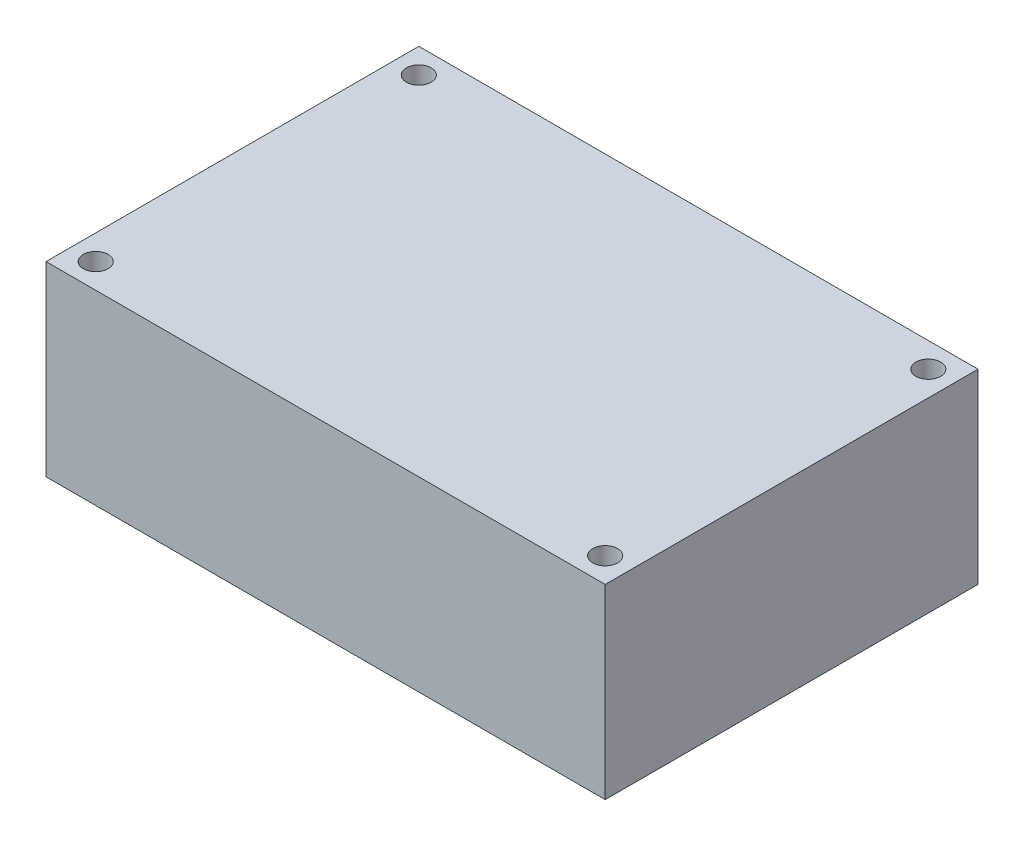
ISO-10303-21;
HEADER;
FILE_DESCRIPTION(('STEP AP214'),'2;1');
FILE_NAME('part.step','',(''),(''),'','','');
FILE_SCHEMA(('AUTOMOTIVE_DESIGN { 1 0 10303 214 1 1 1 1 }'));
ENDSEC;
DATA;
#1=APPLICATION_CONTEXT('core data for automotive mechanical design processes');
#2=APPLICATION_PROTOCOL_DEFINITION('international standard','automotive_design',2000,#1);
#3=PRODUCT_CONTEXT('',#1,'mechanical');
#4=PRODUCT('Part','Part','',(#3));
#5=PRODUCT_RELATED_PRODUCT_CATEGORY('part','',(#4));
#6=PRODUCT_DEFINITION_FORMATION('','',#4);
#7=PRODUCT_DEFINITION_CONTEXT('part definition',#1,'design');
#8=PRODUCT_DEFINITION('design','',#6,#7);
#9=PRODUCT_DEFINITION_SHAPE('','',#8);
#10=(LENGTH_UNIT() NAMED_UNIT(*) SI_UNIT(.MILLI.,.METRE.));
#11=(NAMED_UNIT(*) PLANE_ANGLE_UNIT() SI_UNIT($,.RADIAN.));
#12=(NAMED_UNIT(*) SI_UNIT($,.STERADIAN.) SOLID_ANGLE_UNIT());
#13=UNCERTAINTY_MEASURE_WITH_UNIT(LENGTH_MEASURE(1.E-05),#10,'distance_accuracy_value','');
#14=(GEOMETRIC_REPRESENTATION_CONTEXT(3) GLOBAL_UNCERTAINTY_ASSIGNED_CONTEXT((#13)) GLOBAL_UNIT_ASSIGNED_CONTEXT((#10,
#11,#12)) REPRESENTATION_CONTEXT('',''));
#15=CARTESIAN_POINT('',(0.,0.,0.));
#16=DIRECTION('',(0.,0.,1.));
#17=DIRECTION('',(1.,0.,0.));
#18=AXIS2_PLACEMENT_3D('',#15,#16,#17);
#19=CARTESIAN_POINT('',(0.,15.,0.));
#20=DIRECTION('',(0.,-1.,0.));
#21=DIRECTION('',(0.,0.,-1.));
#22=AXIS2_PLACEMENT_3D('',#19,#20,#21);
#23=PLANE('',#22);
#24=DIRECTION('',(0.,0.,-1.));
#25=VECTOR('',#24,1.);
#26=CARTESIAN_POINT('',(0.,15.,0.));
#27=LINE('',#26,#25);
#28=CARTESIAN_POINT('',(0.,15.,30.));
#29=VERTEX_POINT('',#28);
#30=CARTESIAN_POINT('',(0.,15.,0.));
#31=VERTEX_POINT('',#30);
#32=EDGE_CURVE('E85',#29,#31,#27,.T.);
#33=ORIENTED_EDGE('',*,*,#32,.T.);
#34=DIRECTION('',(-1.,0.,0.));
#35=VECTOR('',#34,1.);
#36=CARTESIAN_POINT('',(0.,15.,0.));
#37=LINE('',#36,#35);
#38=CARTESIAN_POINT('',(-45.,15.,0.));
#39=VERTEX_POINT('',#38);
#40=EDGE_CURVE('E80',#31,#39,#37,.T.);
#41=ORIENTED_EDGE('',*,*,#40,.T.);
#42=DIRECTION('',(0.,0.,1.));
#43=VECTOR('',#42,1.);
#44=CARTESIAN_POINT('',(-45.,15.,0.));
#45=LINE('',#44,#43);
#46=CARTESIAN_POINT('',(-45.,15.,30.));
#47=VERTEX_POINT('',#46);
#48=EDGE_CURVE('E83',#39,#47,#45,.T.);
#49=ORIENTED_EDGE('',*,*,#48,.T.);
#50=DIRECTION('',(1.,0.,0.));
#51=VECTOR('',#50,1.);
#52=CARTESIAN_POINT('',(0.,15.,30.));
#53=LINE('',#52,#51);
#54=EDGE_CURVE('E50',#47,#29,#53,.T.);
#55=ORIENTED_EDGE('',*,*,#54,.T.);
#56=EDGE_LOOP('',(#33,#41,#49,#55));
#57=FACE_BOUND('',#56,.T.);
#58=CARTESIAN_POINT('',(-43.,15.,28.));
#59=DIRECTION('',(0.,1.,0.));
#60=DIRECTION('',(0.,0.,1.));
#61=AXIS2_PLACEMENT_3D('',#58,#59,#60);
#62=CIRCLE('',#61,0.999999999999998);
#63=CARTESIAN_POINT('',(-43.,15.,29.));
#64=VERTEX_POINT('',#63);
#65=EDGE_CURVE('E100',#64,#64,#62,.T.);
#66=ORIENTED_EDGE('',*,*,#65,.F.);
#67=EDGE_LOOP('',(#66));
#68=FACE_BOUND('',#67,.T.);
#69=CARTESIAN_POINT('',(-43.,15.,2.00000000000001));
#70=DIRECTION('',(0.,1.,0.));
#71=DIRECTION('',(0.,0.,1.));
#72=AXIS2_PLACEMENT_3D('',#69,#70,#71);
#73=CIRCLE('',#72,0.999999999999998);
#74=CARTESIAN_POINT('',(-43.,15.,3.));
#75=VERTEX_POINT('',#74);
#76=EDGE_CURVE('E115',#75,#75,#73,.T.);
#77=ORIENTED_EDGE('',*,*,#76,.F.);
#78=EDGE_LOOP('',(#77));
#79=FACE_BOUND('',#78,.T.);
#80=CARTESIAN_POINT('',(-2.,15.,2.00000000000001));
#81=DIRECTION('',(0.,1.,0.));
#82=DIRECTION('',(0.,0.,1.));
#83=AXIS2_PLACEMENT_3D('',#80,#81,#82);
#84=CIRCLE('',#83,1.);
#85=CARTESIAN_POINT('',(-2.,15.,3.00000000000001));
#86=VERTEX_POINT('',#85);
#87=EDGE_CURVE('E121',#86,#86,#84,.T.);
#88=ORIENTED_EDGE('',*,*,#87,.F.);
#89=EDGE_LOOP('',(#88));
#90=FACE_BOUND('',#89,.T.);
#91=CARTESIAN_POINT('',(-2.,15.,28.));
#92=DIRECTION('',(0.,1.,0.));
#93=DIRECTION('',(0.,0.,1.));
#94=AXIS2_PLACEMENT_3D('',#91,#92,#93);
#95=CIRCLE('',#94,1.);
#96=CARTESIAN_POINT('',(-2.,15.,29.));
#97=VERTEX_POINT('',#96);
#98=EDGE_CURVE('E127',#97,#97,#95,.T.);
#99=ORIENTED_EDGE('',*,*,#98,.F.);
#100=EDGE_LOOP('',(#99));
#101=FACE_BOUND('',#100,.T.);
#102=ADVANCED_FACE('F33',(#57,#68,#79,#90,#101),#23,.F.);
#103=CARTESIAN_POINT('',(0.,0.,0.));
#104=DIRECTION('',(0.,-1.,0.));
#105=DIRECTION('',(0.,0.,-1.));
#106=AXIS2_PLACEMENT_3D('',#103,#104,#105);
#107=PLANE('',#106);
#108=CARTESIAN_POINT('',(-2.,0.,2.00000000000001));
#109=DIRECTION('',(0.,1.,0.));
#110=DIRECTION('',(0.,0.,1.));
#111=AXIS2_PLACEMENT_3D('',#108,#109,#110);
#112=CIRCLE('',#111,1.);
#113=CARTESIAN_POINT('',(-2.,0.,3.00000000000001));
#114=VERTEX_POINT('',#113);
#115=EDGE_CURVE('E124',#114,#114,#112,.T.);
#116=ORIENTED_EDGE('',*,*,#115,.T.);
#117=EDGE_LOOP('',(#116));
#118=FACE_BOUND('',#117,.T.);
#119=CARTESIAN_POINT('',(-43.,0.,28.));
#120=DIRECTION('',(0.,1.,0.));
#121=DIRECTION('',(0.,0.,1.));
#122=AXIS2_PLACEMENT_3D('',#119,#120,#121);
#123=CIRCLE('',#122,0.999999999999998);
#124=CARTESIAN_POINT('',(-43.,0.,29.));
#125=VERTEX_POINT('',#124);
#126=EDGE_CURVE('E112',#125,#125,#123,.T.);
#127=ORIENTED_EDGE('',*,*,#126,.T.);
#128=EDGE_LOOP('',(#127));
#129=FACE_BOUND('',#128,.T.);
#130=DIRECTION('',(0.,0.,-1.));
#131=VECTOR('',#130,1.);
#132=CARTESIAN_POINT('',(0.,0.,0.));
#133=LINE('',#132,#131);
#134=CARTESIAN_POINT('',(0.,0.,30.));
#135=VERTEX_POINT('',#134);
#136=CARTESIAN_POINT('',(0.,0.,0.));
#137=VERTEX_POINT('',#136);
#138=EDGE_CURVE('E97',#135,#137,#133,.T.);
#139=ORIENTED_EDGE('',*,*,#138,.F.);
#140=DIRECTION('',(1.,0.,0.));
#141=VECTOR('',#140,1.);
#142=CARTESIAN_POINT('',(0.,0.,30.));
#143=LINE('',#142,#141);
#144=CARTESIAN_POINT('',(-45.,0.,30.));
#145=VERTEX_POINT('',#144);
#146=EDGE_CURVE('E73',#145,#135,#143,.T.);
#147=ORIENTED_EDGE('',*,*,#146,.F.);
#148=DIRECTION('',(0.,0.,1.));
#149=VECTOR('',#148,1.);
#150=CARTESIAN_POINT('',(-45.,0.,0.));
#151=LINE('',#150,#149);
#152=CARTESIAN_POINT('',(-45.,0.,0.));
#153=VERTEX_POINT('',#152);
#154=EDGE_CURVE('E67',#153,#145,#151,.T.);
#155=ORIENTED_EDGE('',*,*,#154,.F.);
#156=DIRECTION('',(-1.,0.,0.));
#157=VECTOR('',#156,1.);
#158=CARTESIAN_POINT('',(0.,0.,0.));
#159=LINE('',#158,#157);
#160=EDGE_CURVE('E89',#137,#153,#159,.T.);
#161=ORIENTED_EDGE('',*,*,#160,.F.);
#162=EDGE_LOOP('',(#139,#147,#155,#161));
#163=FACE_BOUND('',#162,.T.);
#164=CARTESIAN_POINT('',(-43.,0.,2.00000000000001));
#165=DIRECTION('',(0.,1.,0.));
#166=DIRECTION('',(0.,0.,1.));
#167=AXIS2_PLACEMENT_3D('',#164,#165,#166);
#168=CIRCLE('',#167,0.999999999999998);
#169=CARTESIAN_POINT('',(-43.,0.,3.));
#170=VERTEX_POINT('',#169);
#171=EDGE_CURVE('E118',#170,#170,#168,.T.);
#172=ORIENTED_EDGE('',*,*,#171,.T.);
#173=EDGE_LOOP('',(#172));
#174=FACE_BOUND('',#173,.T.);
#175=CARTESIAN_POINT('',(-2.,0.,28.));
#176=DIRECTION('',(0.,1.,0.));
#177=DIRECTION('',(0.,0.,1.));
#178=AXIS2_PLACEMENT_3D('',#175,#176,#177);
#179=CIRCLE('',#178,1.);
#180=CARTESIAN_POINT('',(-2.,0.,29.));
#181=VERTEX_POINT('',#180);
#182=EDGE_CURVE('E130',#181,#181,#179,.T.);
#183=ORIENTED_EDGE('',*,*,#182,.T.);
#184=EDGE_LOOP('',(#183));
#185=FACE_BOUND('',#184,.T.);
#186=ADVANCED_FACE('F108',(#118,#129,#163,#174,#185),#107,.T.);
#187=CARTESIAN_POINT('',(0.,15.,0.));
#188=DIRECTION('',(-1.,0.,0.));
#189=DIRECTION('',(0.,0.,1.));
#190=AXIS2_PLACEMENT_3D('',#187,#188,#189);
#191=PLANE('',#190);
#192=ORIENTED_EDGE('',*,*,#138,.T.);
#193=DIRECTION('',(0.,-1.,0.));
#194=VECTOR('',#193,1.);
#195=CARTESIAN_POINT('',(0.,15.,0.));
#196=LINE('',#195,#194);
#197=EDGE_CURVE('E11',#31,#137,#196,.T.);
#198=ORIENTED_EDGE('',*,*,#197,.F.);
#199=ORIENTED_EDGE('',*,*,#32,.F.);
#200=DIRECTION('',(0.,-1.,0.));
#201=VECTOR('',#200,1.);
#202=CARTESIAN_POINT('',(0.,15.,30.));
#203=LINE('',#202,#201);
#204=EDGE_CURVE('E93',#29,#135,#203,.T.);
#205=ORIENTED_EDGE('',*,*,#204,.T.);
#206=EDGE_LOOP('',(#192,#198,#199,#205));
#207=FACE_BOUND('',#206,.T.);
#208=ADVANCED_FACE('F35',(#207),#191,.F.);
#209=CARTESIAN_POINT('',(0.,15.,0.));
#210=DIRECTION('',(0.,0.,1.));
#211=DIRECTION('',(1.,0.,0.));
#212=AXIS2_PLACEMENT_3D('',#209,#210,#211);
#213=PLANE('',#212);
#214=ORIENTED_EDGE('',*,*,#160,.T.);
#215=DIRECTION('',(0.,-1.,0.));
#216=VECTOR('',#215,1.);
#217=CARTESIAN_POINT('',(-45.,15.,0.));
#218=LINE('',#217,#216);
#219=EDGE_CURVE('E42',#39,#153,#218,.T.);
#220=ORIENTED_EDGE('',*,*,#219,.F.);
#221=ORIENTED_EDGE('',*,*,#40,.F.);
#222=ORIENTED_EDGE('',*,*,#197,.T.);
#223=EDGE_LOOP('',(#214,#220,#221,#222));
#224=FACE_BOUND('',#223,.T.);
#225=ADVANCED_FACE('F88',(#224),#213,.F.);
#226=CARTESIAN_POINT('',(-45.,15.,0.));
#227=DIRECTION('',(1.,0.,0.));
#228=DIRECTION('',(0.,0.,-1.));
#229=AXIS2_PLACEMENT_3D('',#226,#227,#228);
#230=PLANE('',#229);
#231=ORIENTED_EDGE('',*,*,#154,.T.);
#232=DIRECTION('',(0.,-1.,0.));
#233=VECTOR('',#232,1.);
#234=CARTESIAN_POINT('',(-45.,15.,30.));
#235=LINE('',#234,#233);
#236=EDGE_CURVE('E90',#47,#145,#235,.T.);
#237=ORIENTED_EDGE('',*,*,#236,.F.);
#238=ORIENTED_EDGE('',*,*,#48,.F.);
#239=ORIENTED_EDGE('',*,*,#219,.T.);
#240=EDGE_LOOP('',(#231,#237,#238,#239));
#241=FACE_BOUND('',#240,.T.);
#242=ADVANCED_FACE('F91',(#241),#230,.F.);
#243=CARTESIAN_POINT('',(0.,15.,30.));
#244=DIRECTION('',(0.,0.,-1.));
#245=DIRECTION('',(-1.,0.,0.));
#246=AXIS2_PLACEMENT_3D('',#243,#244,#245);
#247=PLANE('',#246);
#248=ORIENTED_EDGE('',*,*,#146,.T.);
#249=ORIENTED_EDGE('',*,*,#204,.F.);
#250=ORIENTED_EDGE('',*,*,#54,.F.);
#251=ORIENTED_EDGE('',*,*,#236,.T.);
#252=EDGE_LOOP('',(#248,#249,#250,#251));
#253=FACE_BOUND('',#252,.T.);
#254=ADVANCED_FACE('F105',(#253),#247,.F.);
#255=CARTESIAN_POINT('',(-43.,15.,28.));
#256=DIRECTION('',(0.,-1.,0.));
#257=DIRECTION('',(0.,0.,-1.));
#258=AXIS2_PLACEMENT_3D('',#255,#256,#257);
#259=CYLINDRICAL_SURFACE('',#258,0.999999999999998);
#260=ORIENTED_EDGE('',*,*,#65,.T.);
#261=EDGE_LOOP('',(#260));
#262=FACE_BOUND('',#261,.T.);
#263=ORIENTED_EDGE('',*,*,#126,.F.);
#264=EDGE_LOOP('',(#263));
#265=FACE_BOUND('',#264,.T.);
#266=ADVANCED_FACE('F147',(#262,#265),#259,.F.);
#267=CARTESIAN_POINT('',(-43.,15.,2.00000000000001));
#268=DIRECTION('',(0.,-1.,0.));
#269=DIRECTION('',(0.,0.,-1.));
#270=AXIS2_PLACEMENT_3D('',#267,#268,#269);
#271=CYLINDRICAL_SURFACE('',#270,0.999999999999998);
#272=ORIENTED_EDGE('',*,*,#76,.T.);
#273=EDGE_LOOP('',(#272));
#274=FACE_BOUND('',#273,.T.);
#275=ORIENTED_EDGE('',*,*,#171,.F.);
#276=EDGE_LOOP('',(#275));
#277=FACE_BOUND('',#276,.T.);
#278=ADVANCED_FACE('F193',(#274,#277),#271,.F.);
#279=CARTESIAN_POINT('',(-2.,15.,2.00000000000001));
#280=DIRECTION('',(0.,-1.,0.));
#281=DIRECTION('',(0.,0.,-1.));
#282=AXIS2_PLACEMENT_3D('',#279,#280,#281);
#283=CYLINDRICAL_SURFACE('',#282,1.);
#284=ORIENTED_EDGE('',*,*,#87,.T.);
#285=EDGE_LOOP('',(#284));
#286=FACE_BOUND('',#285,.T.);
#287=ORIENTED_EDGE('',*,*,#115,.F.);
#288=EDGE_LOOP('',(#287));
#289=FACE_BOUND('',#288,.T.);
#290=ADVANCED_FACE('F201',(#286,#289),#283,.F.);
#291=CARTESIAN_POINT('',(-2.,15.,28.));
#292=DIRECTION('',(0.,-1.,0.));
#293=DIRECTION('',(0.,0.,-1.));
#294=AXIS2_PLACEMENT_3D('',#291,#292,#293);
#295=CYLINDRICAL_SURFACE('',#294,1.);
#296=ORIENTED_EDGE('',*,*,#98,.T.);
#297=EDGE_LOOP('',(#296));
#298=FACE_BOUND('',#297,.T.);
#299=ORIENTED_EDGE('',*,*,#182,.F.);
#300=EDGE_LOOP('',(#299));
#301=FACE_BOUND('',#300,.T.);
#302=ADVANCED_FACE('F136',(#298,#301),#295,.F.);
#303=CLOSED_SHELL('',(#102,#186,#208,#225,#242,#254,#266,#278,#290,#302));
#304=MANIFOLD_SOLID_BREP('B2',#303);
#305=ADVANCED_BREP_SHAPE_REPRESENTATION('',(#18,#304),#14);
#306=SHAPE_DEFINITION_REPRESENTATION(#9,#305);
ENDSEC;
END-ISO-10303-21;
